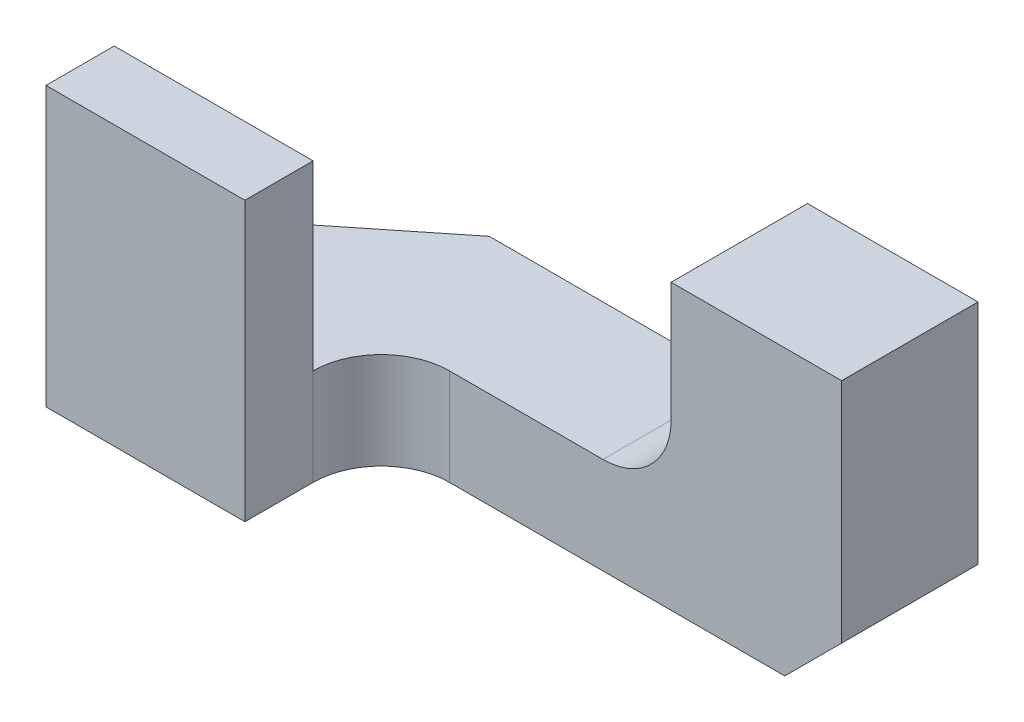
ISO-10303-21;
HEADER;
FILE_DESCRIPTION(('STEP AP214'),'2;1');
FILE_NAME('part.step','',(''),(''),'','','');
FILE_SCHEMA(('AUTOMOTIVE_DESIGN { 1 0 10303 214 1 1 1 1 }'));
ENDSEC;
DATA;
#1=APPLICATION_CONTEXT('core data for automotive mechanical design processes');
#2=APPLICATION_PROTOCOL_DEFINITION('international standard','automotive_design',2000,#1);
#3=PRODUCT_CONTEXT('',#1,'mechanical');
#4=PRODUCT('Part','Part','',(#3));
#5=PRODUCT_RELATED_PRODUCT_CATEGORY('part','',(#4));
#6=PRODUCT_DEFINITION_FORMATION('','',#4);
#7=PRODUCT_DEFINITION_CONTEXT('part definition',#1,'design');
#8=PRODUCT_DEFINITION('design','',#6,#7);
#9=PRODUCT_DEFINITION_SHAPE('','',#8);
#10=(LENGTH_UNIT() NAMED_UNIT(*) SI_UNIT(.MILLI.,.METRE.));
#11=(NAMED_UNIT(*) PLANE_ANGLE_UNIT() SI_UNIT($,.RADIAN.));
#12=(NAMED_UNIT(*) SI_UNIT($,.STERADIAN.) SOLID_ANGLE_UNIT());
#13=UNCERTAINTY_MEASURE_WITH_UNIT(LENGTH_MEASURE(1.E-05),#10,'distance_accuracy_value','');
#14=(GEOMETRIC_REPRESENTATION_CONTEXT(3) GLOBAL_UNCERTAINTY_ASSIGNED_CONTEXT((#13)) GLOBAL_UNIT_ASSIGNED_CONTEXT((#10,
#11,#12)) REPRESENTATION_CONTEXT('',''));
#15=CARTESIAN_POINT('',(0.,0.,0.));
#16=DIRECTION('',(0.,0.,1.));
#17=DIRECTION('',(1.,0.,0.));
#18=AXIS2_PLACEMENT_3D('',#15,#16,#17);
#19=CARTESIAN_POINT('',(7.366,6.35,-3.048));
#20=DIRECTION('',(0.,0.,1.));
#21=DIRECTION('',(1.,0.,0.));
#22=AXIS2_PLACEMENT_3D('',#19,#20,#21);
#23=PLANE('',#22);
#24=DIRECTION('',(0.,1.,0.));
#25=VECTOR('',#24,1.);
#26=CARTESIAN_POINT('',(-3.556,0.,-3.048));
#27=LINE('',#26,#25);
#28=CARTESIAN_POINT('',(-3.556,0.,-3.048));
#29=VERTEX_POINT('',#28);
#30=CARTESIAN_POINT('',(-3.556,2.159,-3.048));
#31=VERTEX_POINT('',#30);
#32=EDGE_CURVE('E185',#29,#31,#27,.T.);
#33=ORIENTED_EDGE('',*,*,#32,.T.);
#34=DIRECTION('',(1.,0.,0.));
#35=VECTOR('',#34,1.);
#36=CARTESIAN_POINT('',(0.,2.159,-3.048));
#37=LINE('',#36,#35);
#38=CARTESIAN_POINT('',(2.032,2.159,-3.048));
#39=VERTEX_POINT('',#38);
#40=EDGE_CURVE('E159',#31,#39,#37,.T.);
#41=ORIENTED_EDGE('',*,*,#40,.T.);
#42=CARTESIAN_POINT('',(2.032,3.683,-3.048));
#43=DIRECTION('',(0.,0.,-1.));
#44=DIRECTION('',(-1.,0.,0.));
#45=AXIS2_PLACEMENT_3D('',#42,#43,#44);
#46=CIRCLE('',#45,1.524);
#47=CARTESIAN_POINT('',(3.556,3.683,-3.048));
#48=VERTEX_POINT('',#47);
#49=EDGE_CURVE('E151',#48,#39,#46,.T.);
#50=ORIENTED_EDGE('',*,*,#49,.F.);
#51=DIRECTION('',(0.,1.,0.));
#52=VECTOR('',#51,1.);
#53=CARTESIAN_POINT('',(3.556,3.683,-3.048));
#54=LINE('',#53,#52);
#55=CARTESIAN_POINT('',(3.556,6.35,-3.048));
#56=VERTEX_POINT('',#55);
#57=EDGE_CURVE('E193',#48,#56,#54,.T.);
#58=ORIENTED_EDGE('',*,*,#57,.T.);
#59=DIRECTION('',(-1.,0.,0.));
#60=VECTOR('',#59,1.);
#61=CARTESIAN_POINT('',(7.366,6.35,-3.048));
#62=LINE('',#61,#60);
#63=CARTESIAN_POINT('',(7.366,6.35,-3.048));
#64=VERTEX_POINT('',#63);
#65=EDGE_CURVE('E218',#64,#56,#62,.T.);
#66=ORIENTED_EDGE('',*,*,#65,.F.);
#67=DIRECTION('',(0.,-1.,0.));
#68=VECTOR('',#67,1.);
#69=CARTESIAN_POINT('',(7.366,6.35,-3.048));
#70=LINE('',#69,#68);
#71=CARTESIAN_POINT('',(7.366,1.27,-3.048));
#72=VERTEX_POINT('',#71);
#73=EDGE_CURVE('E222',#64,#72,#70,.T.);
#74=ORIENTED_EDGE('',*,*,#73,.T.);
#75=DIRECTION('',(0.707106781186548,0.707106781186547,0.));
#76=VECTOR('',#75,1.);
#77=CARTESIAN_POINT('',(7.366,1.27,-3.048));
#78=LINE('',#77,#76);
#79=CARTESIAN_POINT('',(6.096,0.,-3.048));
#80=VERTEX_POINT('',#79);
#81=EDGE_CURVE('E169',#80,#72,#78,.T.);
#82=ORIENTED_EDGE('',*,*,#81,.F.);
#83=DIRECTION('',(-1.,0.,0.));
#84=VECTOR('',#83,1.);
#85=CARTESIAN_POINT('',(7.366,0.,-3.048));
#86=LINE('',#85,#84);
#87=EDGE_CURVE('E219',#80,#29,#86,.T.);
#88=ORIENTED_EDGE('',*,*,#87,.T.);
#89=EDGE_LOOP('',(#33,#41,#50,#58,#66,#74,#82,#88));
#90=FACE_BOUND('',#89,.T.);
#91=ADVANCED_FACE('F34',(#90),#23,.F.);
#92=CARTESIAN_POINT('',(-1.397,0.,1.524));
#93=DIRECTION('',(0.,1.,0.));
#94=DIRECTION('',(0.,0.,1.));
#95=AXIS2_PLACEMENT_3D('',#92,#93,#94);
#96=CYLINDRICAL_SURFACE('',#95,1.524);
#97=CARTESIAN_POINT('',(-1.397,2.159,1.524));
#98=DIRECTION('',(0.,1.,0.));
#99=DIRECTION('',(-1.,0.,0.));
#100=AXIS2_PLACEMENT_3D('',#97,#98,#99);
#101=CIRCLE('',#100,1.524);
#102=CARTESIAN_POINT('',(-2.921,2.159,1.524));
#103=VERTEX_POINT('',#102);
#104=CARTESIAN_POINT('',(-1.397,2.159,0.));
#105=VERTEX_POINT('',#104);
#106=EDGE_CURVE('E167',#103,#105,#101,.F.);
#107=ORIENTED_EDGE('',*,*,#106,.F.);
#108=DIRECTION('',(0.,1.,0.));
#109=VECTOR('',#108,1.);
#110=CARTESIAN_POINT('',(-2.921,0.,1.524));
#111=LINE('',#110,#109);
#112=CARTESIAN_POINT('',(-2.921,0.,1.524));
#113=VERTEX_POINT('',#112);
#114=EDGE_CURVE('E57',#113,#103,#111,.T.);
#115=ORIENTED_EDGE('',*,*,#114,.F.);
#116=CARTESIAN_POINT('',(-1.397,0.,1.524));
#117=DIRECTION('',(0.,1.,0.));
#118=DIRECTION('',(0.,0.,1.));
#119=AXIS2_PLACEMENT_3D('',#116,#117,#118);
#120=CIRCLE('',#119,1.524);
#121=CARTESIAN_POINT('',(-1.397,0.,0.));
#122=VERTEX_POINT('',#121);
#123=EDGE_CURVE('E200',#122,#113,#120,.T.);
#124=ORIENTED_EDGE('',*,*,#123,.F.);
#125=DIRECTION('',(0.,1.,0.));
#126=VECTOR('',#125,1.);
#127=CARTESIAN_POINT('',(-1.397,0.,0.));
#128=LINE('',#127,#126);
#129=EDGE_CURVE('E205',#122,#105,#128,.T.);
#130=ORIENTED_EDGE('',*,*,#129,.T.);
#131=EDGE_LOOP('',(#107,#115,#124,#130));
#132=FACE_BOUND('',#131,.T.);
#133=ADVANCED_FACE('F278',(#132),#96,.F.);
#134=CARTESIAN_POINT('',(0.,0.,0.));
#135=DIRECTION('',(0.,0.,-1.));
#136=DIRECTION('',(-1.,0.,0.));
#137=AXIS2_PLACEMENT_3D('',#134,#135,#136);
#138=PLANE('',#137);
#139=DIRECTION('',(1.,0.,0.));
#140=VECTOR('',#139,1.);
#141=CARTESIAN_POINT('',(0.,2.159,0.));
#142=LINE('',#141,#140);
#143=CARTESIAN_POINT('',(2.032,2.159,0.));
#144=VERTEX_POINT('',#143);
#145=EDGE_CURVE('E42',#105,#144,#142,.T.);
#146=ORIENTED_EDGE('',*,*,#145,.F.);
#147=ORIENTED_EDGE('',*,*,#129,.F.);
#148=DIRECTION('',(-1.,0.,0.));
#149=VECTOR('',#148,1.);
#150=CARTESIAN_POINT('',(0.,0.,0.));
#151=LINE('',#150,#149);
#152=CARTESIAN_POINT('',(6.096,0.,0.));
#153=VERTEX_POINT('',#152);
#154=EDGE_CURVE('E198',#153,#122,#151,.T.);
#155=ORIENTED_EDGE('',*,*,#154,.F.);
#156=DIRECTION('',(0.707106781186548,0.707106781186547,0.));
#157=VECTOR('',#156,1.);
#158=CARTESIAN_POINT('',(3.048,-3.048,0.));
#159=LINE('',#158,#157);
#160=CARTESIAN_POINT('',(7.366,1.27,0.));
#161=VERTEX_POINT('',#160);
#162=EDGE_CURVE('E236',#153,#161,#159,.T.);
#163=ORIENTED_EDGE('',*,*,#162,.T.);
#164=DIRECTION('',(0.,1.,0.));
#165=VECTOR('',#164,1.);
#166=CARTESIAN_POINT('',(7.366,0.,0.));
#167=LINE('',#166,#165);
#168=CARTESIAN_POINT('',(7.366,6.35,0.));
#169=VERTEX_POINT('',#168);
#170=EDGE_CURVE('E208',#161,#169,#167,.T.);
#171=ORIENTED_EDGE('',*,*,#170,.T.);
#172=DIRECTION('',(-1.,0.,0.));
#173=VECTOR('',#172,1.);
#174=CARTESIAN_POINT('',(0.,6.35,0.));
#175=LINE('',#174,#173);
#176=CARTESIAN_POINT('',(3.556,6.35,0.));
#177=VERTEX_POINT('',#176);
#178=EDGE_CURVE('E197',#169,#177,#175,.T.);
#179=ORIENTED_EDGE('',*,*,#178,.T.);
#180=DIRECTION('',(0.,-1.,0.));
#181=VECTOR('',#180,1.);
#182=CARTESIAN_POINT('',(3.556,0.,0.));
#183=LINE('',#182,#181);
#184=CARTESIAN_POINT('',(3.556,3.683,0.));
#185=VERTEX_POINT('',#184);
#186=EDGE_CURVE('E233',#177,#185,#183,.T.);
#187=ORIENTED_EDGE('',*,*,#186,.T.);
#188=CARTESIAN_POINT('',(2.032,3.683,0.));
#189=DIRECTION('',(0.,0.,-1.));
#190=DIRECTION('',(-1.,0.,0.));
#191=AXIS2_PLACEMENT_3D('',#188,#189,#190);
#192=CIRCLE('',#191,1.524);
#193=EDGE_CURVE('E164',#185,#144,#192,.T.);
#194=ORIENTED_EDGE('',*,*,#193,.T.);
#195=EDGE_LOOP('',(#146,#147,#155,#163,#171,#179,#187,#194));
#196=FACE_BOUND('',#195,.T.);
#197=ADVANCED_FACE('F245',(#196),#138,.F.);
#198=CARTESIAN_POINT('',(-7.366,6.35,3.048));
#199=DIRECTION('',(1.,0.,0.));
#200=DIRECTION('',(0.,0.,-1.));
#201=AXIS2_PLACEMENT_3D('',#198,#199,#200);
#202=PLANE('',#201);
#203=DIRECTION('',(0.,-1.,0.));
#204=VECTOR('',#203,1.);
#205=CARTESIAN_POINT('',(-7.366,6.223,1.524));
#206=LINE('',#205,#204);
#207=CARTESIAN_POINT('',(-7.366,6.223,1.524));
#208=VERTEX_POINT('',#207);
#209=CARTESIAN_POINT('',(-7.366,2.159,1.524));
#210=VERTEX_POINT('',#209);
#211=EDGE_CURVE('E134',#208,#210,#206,.T.);
#212=ORIENTED_EDGE('',*,*,#211,.T.);
#213=DIRECTION('',(0.,0.,-1.));
#214=VECTOR('',#213,1.);
#215=CARTESIAN_POINT('',(-7.366,2.159,1.524));
#216=LINE('',#215,#214);
#217=CARTESIAN_POINT('',(-7.366,2.159,0.));
#218=VERTEX_POINT('',#217);
#219=EDGE_CURVE('E137',#210,#218,#216,.T.);
#220=ORIENTED_EDGE('',*,*,#219,.T.);
#221=DIRECTION('',(0.,1.,0.));
#222=VECTOR('',#221,1.);
#223=CARTESIAN_POINT('',(-7.366,0.,0.));
#224=LINE('',#223,#222);
#225=CARTESIAN_POINT('',(-7.366,0.,0.));
#226=VERTEX_POINT('',#225);
#227=EDGE_CURVE('E186',#226,#218,#224,.T.);
#228=ORIENTED_EDGE('',*,*,#227,.F.);
#229=DIRECTION('',(0.,0.,1.));
#230=VECTOR('',#229,1.);
#231=CARTESIAN_POINT('',(-7.366,0.,3.048));
#232=LINE('',#231,#230);
#233=CARTESIAN_POINT('',(-7.366,0.,3.048));
#234=VERTEX_POINT('',#233);
#235=EDGE_CURVE('E210',#226,#234,#232,.T.);
#236=ORIENTED_EDGE('',*,*,#235,.T.);
#237=DIRECTION('',(0.,-1.,0.));
#238=VECTOR('',#237,1.);
#239=CARTESIAN_POINT('',(-7.366,6.35,3.048));
#240=LINE('',#239,#238);
#241=CARTESIAN_POINT('',(-7.366,6.223,3.048));
#242=VERTEX_POINT('',#241);
#243=EDGE_CURVE('E230',#242,#234,#240,.T.);
#244=ORIENTED_EDGE('',*,*,#243,.F.);
#245=DIRECTION('',(0.,0.,1.));
#246=VECTOR('',#245,1.);
#247=CARTESIAN_POINT('',(-7.366,6.223,3.048));
#248=LINE('',#247,#246);
#249=EDGE_CURVE('E140',#208,#242,#248,.T.);
#250=ORIENTED_EDGE('',*,*,#249,.F.);
#251=EDGE_LOOP('',(#212,#220,#228,#236,#244,#250));
#252=FACE_BOUND('',#251,.T.);
#253=ADVANCED_FACE('F36',(#252),#202,.F.);
#254=CARTESIAN_POINT('',(0.,0.,0.));
#255=DIRECTION('',(0.,1.,0.));
#256=DIRECTION('',(0.,0.,1.));
#257=AXIS2_PLACEMENT_3D('',#254,#255,#256);
#258=PLANE('',#257);
#259=ORIENTED_EDGE('',*,*,#87,.F.);
#260=DIRECTION('',(0.,0.,-1.));
#261=VECTOR('',#260,1.);
#262=CARTESIAN_POINT('',(6.096,0.,3.048));
#263=LINE('',#262,#261);
#264=EDGE_CURVE('E171',#153,#80,#263,.T.);
#265=ORIENTED_EDGE('',*,*,#264,.F.);
#266=ORIENTED_EDGE('',*,*,#154,.T.);
#267=ORIENTED_EDGE('',*,*,#123,.T.);
#268=DIRECTION('',(0.,0.,-1.));
#269=VECTOR('',#268,1.);
#270=CARTESIAN_POINT('',(-2.921,0.,0.));
#271=LINE('',#270,#269);
#272=CARTESIAN_POINT('',(-2.921,0.,3.048));
#273=VERTEX_POINT('',#272);
#274=EDGE_CURVE('E203',#273,#113,#271,.T.);
#275=ORIENTED_EDGE('',*,*,#274,.F.);
#276=DIRECTION('',(1.,0.,0.));
#277=VECTOR('',#276,1.);
#278=CARTESIAN_POINT('',(7.366,0.,3.048));
#279=LINE('',#278,#277);
#280=EDGE_CURVE('E224',#234,#273,#279,.T.);
#281=ORIENTED_EDGE('',*,*,#280,.F.);
#282=ORIENTED_EDGE('',*,*,#235,.F.);
#283=DIRECTION('',(-0.78086880944303,0.,0.624695047554424));
#284=VECTOR('',#283,1.);
#285=CARTESIAN_POINT('',(-2.87453658536585,0.,-3.59317073170732));
#286=LINE('',#285,#284);
#287=EDGE_CURVE('E183',#29,#226,#286,.T.);
#288=ORIENTED_EDGE('',*,*,#287,.F.);
#289=EDGE_LOOP('',(#259,#265,#266,#267,#275,#281,#282,#288));
#290=FACE_BOUND('',#289,.T.);
#291=ADVANCED_FACE('F266',(#290),#258,.F.);
#292=CARTESIAN_POINT('',(7.366,6.35,3.048));
#293=DIRECTION('',(0.,0.,-1.));
#294=DIRECTION('',(-1.,0.,0.));
#295=AXIS2_PLACEMENT_3D('',#292,#293,#294);
#296=PLANE('',#295);
#297=DIRECTION('',(0.,1.,0.));
#298=VECTOR('',#297,1.);
#299=CARTESIAN_POINT('',(-2.921,0.,3.048));
#300=LINE('',#299,#298);
#301=CARTESIAN_POINT('',(-2.921,6.223,3.048));
#302=VERTEX_POINT('',#301);
#303=EDGE_CURVE('E211',#273,#302,#300,.T.);
#304=ORIENTED_EDGE('',*,*,#303,.T.);
#305=DIRECTION('',(1.,0.,0.));
#306=VECTOR('',#305,1.);
#307=CARTESIAN_POINT('',(-2.921,6.223,3.048));
#308=LINE('',#307,#306);
#309=EDGE_CURVE('E144',#242,#302,#308,.T.);
#310=ORIENTED_EDGE('',*,*,#309,.F.);
#311=ORIENTED_EDGE('',*,*,#243,.T.);
#312=ORIENTED_EDGE('',*,*,#280,.T.);
#313=EDGE_LOOP('',(#304,#310,#311,#312));
#314=FACE_BOUND('',#313,.T.);
#315=ADVANCED_FACE('F269',(#314),#296,.F.);
#316=CARTESIAN_POINT('',(-2.921,0.,0.));
#317=DIRECTION('',(1.,0.,0.));
#318=DIRECTION('',(0.,0.,-1.));
#319=AXIS2_PLACEMENT_3D('',#316,#317,#318);
#320=PLANE('',#319);
#321=ORIENTED_EDGE('',*,*,#114,.T.);
#322=DIRECTION('',(0.,-1.,0.));
#323=VECTOR('',#322,1.);
#324=CARTESIAN_POINT('',(-2.921,6.223,1.524));
#325=LINE('',#324,#323);
#326=CARTESIAN_POINT('',(-2.921,6.223,1.524));
#327=VERTEX_POINT('',#326);
#328=EDGE_CURVE('E143',#327,#103,#325,.T.);
#329=ORIENTED_EDGE('',*,*,#328,.F.);
#330=DIRECTION('',(0.,0.,-1.));
#331=VECTOR('',#330,1.);
#332=CARTESIAN_POINT('',(-2.921,6.223,3.048));
#333=LINE('',#332,#331);
#334=EDGE_CURVE('E173',#302,#327,#333,.T.);
#335=ORIENTED_EDGE('',*,*,#334,.F.);
#336=ORIENTED_EDGE('',*,*,#303,.F.);
#337=ORIENTED_EDGE('',*,*,#274,.T.);
#338=EDGE_LOOP('',(#321,#329,#335,#336,#337));
#339=FACE_BOUND('',#338,.T.);
#340=ADVANCED_FACE('F275',(#339),#320,.T.);
#341=CARTESIAN_POINT('',(7.366,6.35,3.048));
#342=DIRECTION('',(-1.,0.,0.));
#343=DIRECTION('',(0.,0.,1.));
#344=AXIS2_PLACEMENT_3D('',#341,#342,#343);
#345=PLANE('',#344);
#346=ORIENTED_EDGE('',*,*,#170,.F.);
#347=DIRECTION('',(0.,0.,-1.));
#348=VECTOR('',#347,1.);
#349=CARTESIAN_POINT('',(7.366,1.27,3.048));
#350=LINE('',#349,#348);
#351=EDGE_CURVE('E49',#161,#72,#350,.T.);
#352=ORIENTED_EDGE('',*,*,#351,.T.);
#353=ORIENTED_EDGE('',*,*,#73,.F.);
#354=DIRECTION('',(0.,0.,-1.));
#355=VECTOR('',#354,1.);
#356=CARTESIAN_POINT('',(7.366,6.35,3.048));
#357=LINE('',#356,#355);
#358=EDGE_CURVE('E216',#169,#64,#357,.T.);
#359=ORIENTED_EDGE('',*,*,#358,.F.);
#360=EDGE_LOOP('',(#346,#352,#353,#359));
#361=FACE_BOUND('',#360,.T.);
#362=ADVANCED_FACE('F281',(#361),#345,.F.);
#363=CARTESIAN_POINT('',(0.,6.35,0.));
#364=DIRECTION('',(0.,1.,0.));
#365=DIRECTION('',(0.,0.,1.));
#366=AXIS2_PLACEMENT_3D('',#363,#364,#365);
#367=PLANE('',#366);
#368=DIRECTION('',(0.,0.,-1.));
#369=VECTOR('',#368,1.);
#370=CARTESIAN_POINT('',(3.556,6.35,-3.048));
#371=LINE('',#370,#369);
#372=EDGE_CURVE('E188',#177,#56,#371,.T.);
#373=ORIENTED_EDGE('',*,*,#372,.F.);
#374=ORIENTED_EDGE('',*,*,#178,.F.);
#375=ORIENTED_EDGE('',*,*,#358,.T.);
#376=ORIENTED_EDGE('',*,*,#65,.T.);
#377=EDGE_LOOP('',(#373,#374,#375,#376));
#378=FACE_BOUND('',#377,.T.);
#379=ADVANCED_FACE('F252',(#378),#367,.T.);
#380=CARTESIAN_POINT('',(3.556,3.683,-3.048));
#381=DIRECTION('',(1.,0.,0.));
#382=DIRECTION('',(0.,0.,-1.));
#383=AXIS2_PLACEMENT_3D('',#380,#381,#382);
#384=PLANE('',#383);
#385=ORIENTED_EDGE('',*,*,#372,.T.);
#386=ORIENTED_EDGE('',*,*,#57,.F.);
#387=DIRECTION('',(0.,0.,-1.));
#388=VECTOR('',#387,1.);
#389=CARTESIAN_POINT('',(3.556,3.683,-3.048));
#390=LINE('',#389,#388);
#391=EDGE_CURVE('E191',#185,#48,#390,.T.);
#392=ORIENTED_EDGE('',*,*,#391,.F.);
#393=ORIENTED_EDGE('',*,*,#186,.F.);
#394=EDGE_LOOP('',(#385,#386,#392,#393));
#395=FACE_BOUND('',#394,.T.);
#396=ADVANCED_FACE('F249',(#395),#384,.F.);
#397=CARTESIAN_POINT('',(-2.87453658536585,0.,-3.59317073170732));
#398=DIRECTION('',(-0.624695047554424,0.,-0.78086880944303));
#399=DIRECTION('',(-0.78086880944303,0.,0.624695047554424));
#400=AXIS2_PLACEMENT_3D('',#397,#398,#399);
#401=PLANE('',#400);
#402=DIRECTION('',(-0.78086880944303,0.,0.624695047554424));
#403=VECTOR('',#402,1.);
#404=CARTESIAN_POINT('',(-2.87453658536585,2.159,-3.59317073170732));
#405=LINE('',#404,#403);
#406=EDGE_CURVE('E11',#31,#218,#405,.T.);
#407=ORIENTED_EDGE('',*,*,#406,.F.);
#408=ORIENTED_EDGE('',*,*,#32,.F.);
#409=ORIENTED_EDGE('',*,*,#287,.T.);
#410=ORIENTED_EDGE('',*,*,#227,.T.);
#411=EDGE_LOOP('',(#407,#408,#409,#410));
#412=FACE_BOUND('',#411,.T.);
#413=ADVANCED_FACE('F260',(#412),#401,.T.);
#414=CARTESIAN_POINT('',(-2.921,6.223,1.524));
#415=DIRECTION('',(0.,0.,1.));
#416=DIRECTION('',(1.,0.,0.));
#417=AXIS2_PLACEMENT_3D('',#414,#415,#416);
#418=PLANE('',#417);
#419=ORIENTED_EDGE('',*,*,#328,.T.);
#420=DIRECTION('',(-1.,0.,0.));
#421=VECTOR('',#420,1.);
#422=CARTESIAN_POINT('',(-2.921,2.159,1.524));
#423=LINE('',#422,#421);
#424=EDGE_CURVE('E149',#103,#210,#423,.T.);
#425=ORIENTED_EDGE('',*,*,#424,.T.);
#426=ORIENTED_EDGE('',*,*,#211,.F.);
#427=DIRECTION('',(-1.,0.,0.));
#428=VECTOR('',#427,1.);
#429=CARTESIAN_POINT('',(-2.921,6.223,1.524));
#430=LINE('',#429,#428);
#431=EDGE_CURVE('E177',#327,#208,#430,.T.);
#432=ORIENTED_EDGE('',*,*,#431,.F.);
#433=EDGE_LOOP('',(#419,#425,#426,#432));
#434=FACE_BOUND('',#433,.T.);
#435=ADVANCED_FACE('F153',(#434),#418,.F.);
#436=CARTESIAN_POINT('',(0.,6.223,0.));
#437=DIRECTION('',(0.,1.,0.));
#438=DIRECTION('',(0.,0.,1.));
#439=AXIS2_PLACEMENT_3D('',#436,#437,#438);
#440=PLANE('',#439);
#441=ORIENTED_EDGE('',*,*,#334,.T.);
#442=ORIENTED_EDGE('',*,*,#431,.T.);
#443=ORIENTED_EDGE('',*,*,#249,.T.);
#444=ORIENTED_EDGE('',*,*,#309,.T.);
#445=EDGE_LOOP('',(#441,#442,#443,#444));
#446=FACE_BOUND('',#445,.T.);
#447=ADVANCED_FACE('F272',(#446),#440,.T.);
#448=CARTESIAN_POINT('',(7.366,1.27,3.048));
#449=DIRECTION('',(-0.707106781186547,0.707106781186548,0.));
#450=DIRECTION('',(-0.707106781186548,-0.707106781186547,0.));
#451=AXIS2_PLACEMENT_3D('',#448,#449,#450);
#452=PLANE('',#451);
#453=ORIENTED_EDGE('',*,*,#264,.T.);
#454=ORIENTED_EDGE('',*,*,#81,.T.);
#455=ORIENTED_EDGE('',*,*,#351,.F.);
#456=ORIENTED_EDGE('',*,*,#162,.F.);
#457=EDGE_LOOP('',(#453,#454,#455,#456));
#458=FACE_BOUND('',#457,.T.);
#459=ADVANCED_FACE('F309',(#458),#452,.F.);
#460=CARTESIAN_POINT('',(0.,2.159,1.143));
#461=DIRECTION('',(0.,1.,0.));
#462=DIRECTION('',(-1.,0.,0.));
#463=AXIS2_PLACEMENT_3D('',#460,#461,#462);
#464=PLANE('',#463);
#465=ORIENTED_EDGE('',*,*,#106,.T.);
#466=ORIENTED_EDGE('',*,*,#145,.T.);
#467=DIRECTION('',(0.,0.,-1.));
#468=VECTOR('',#467,1.);
#469=CARTESIAN_POINT('',(2.032,2.159,1.143));
#470=LINE('',#469,#468);
#471=EDGE_CURVE('E162',#144,#39,#470,.T.);
#472=ORIENTED_EDGE('',*,*,#471,.T.);
#473=ORIENTED_EDGE('',*,*,#40,.F.);
#474=ORIENTED_EDGE('',*,*,#406,.T.);
#475=ORIENTED_EDGE('',*,*,#219,.F.);
#476=ORIENTED_EDGE('',*,*,#424,.F.);
#477=EDGE_LOOP('',(#465,#466,#472,#473,#474,#475,#476));
#478=FACE_BOUND('',#477,.T.);
#479=ADVANCED_FACE('F148',(#478),#464,.T.);
#480=CARTESIAN_POINT('',(2.032,3.683,1.143));
#481=DIRECTION('',(0.,0.,-1.));
#482=DIRECTION('',(-1.,0.,0.));
#483=AXIS2_PLACEMENT_3D('',#480,#481,#482);
#484=CYLINDRICAL_SURFACE('',#483,1.524);
#485=ORIENTED_EDGE('',*,*,#391,.T.);
#486=ORIENTED_EDGE('',*,*,#49,.T.);
#487=ORIENTED_EDGE('',*,*,#471,.F.);
#488=ORIENTED_EDGE('',*,*,#193,.F.);
#489=EDGE_LOOP('',(#485,#486,#487,#488));
#490=FACE_BOUND('',#489,.T.);
#491=ADVANCED_FACE('F242',(#490),#484,.F.);
#492=CLOSED_SHELL('',(#91,#133,#197,#253,#291,#315,#340,#362,#379,#396,#413,#435,#447,#459,#479,#491));
#493=MANIFOLD_SOLID_BREP('B2',#492);
#494=ADVANCED_BREP_SHAPE_REPRESENTATION('',(#18,#493),#14);
#495=SHAPE_DEFINITION_REPRESENTATION(#9,#494);
ENDSEC;
END-ISO-10303-21;
